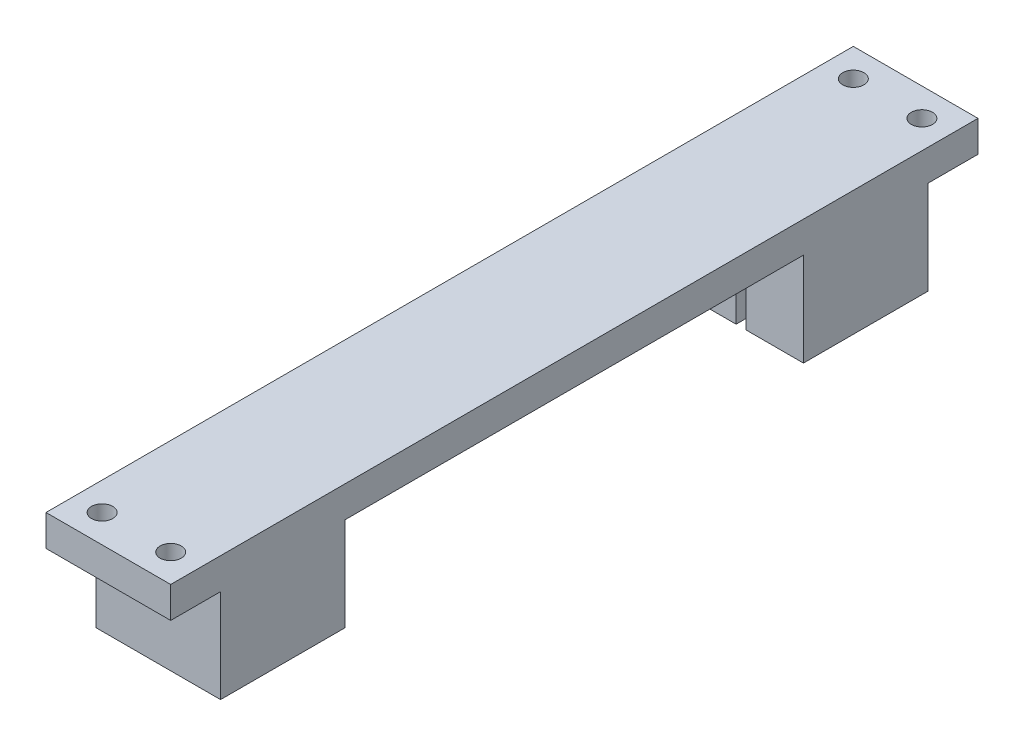
ISO-10303-21;
HEADER;
FILE_DESCRIPTION(('STEP AP214'),'2;1');
FILE_NAME('part.step','',(''),(''),'','','');
FILE_SCHEMA(('AUTOMOTIVE_DESIGN { 1 0 10303 214 1 1 1 1 }'));
ENDSEC;
DATA;
#1=APPLICATION_CONTEXT('core data for automotive mechanical design processes');
#2=APPLICATION_PROTOCOL_DEFINITION('international standard','automotive_design',2000,#1);
#3=PRODUCT_CONTEXT('',#1,'mechanical');
#4=PRODUCT('Part','Part','',(#3));
#5=PRODUCT_RELATED_PRODUCT_CATEGORY('part','',(#4));
#6=PRODUCT_DEFINITION_FORMATION('','',#4);
#7=PRODUCT_DEFINITION_CONTEXT('part definition',#1,'design');
#8=PRODUCT_DEFINITION('design','',#6,#7);
#9=PRODUCT_DEFINITION_SHAPE('','',#8);
#10=(LENGTH_UNIT() NAMED_UNIT(*) SI_UNIT(.MILLI.,.METRE.));
#11=(NAMED_UNIT(*) PLANE_ANGLE_UNIT() SI_UNIT($,.RADIAN.));
#12=(NAMED_UNIT(*) SI_UNIT($,.STERADIAN.) SOLID_ANGLE_UNIT());
#13=UNCERTAINTY_MEASURE_WITH_UNIT(LENGTH_MEASURE(1.E-05),#10,'distance_accuracy_value','');
#14=(GEOMETRIC_REPRESENTATION_CONTEXT(3) GLOBAL_UNCERTAINTY_ASSIGNED_CONTEXT((#13)) GLOBAL_UNIT_ASSIGNED_CONTEXT((#10,
#11,#12)) REPRESENTATION_CONTEXT('',''));
#15=CARTESIAN_POINT('',(0.,0.,0.));
#16=DIRECTION('',(0.,0.,1.));
#17=DIRECTION('',(1.,0.,0.));
#18=AXIS2_PLACEMENT_3D('',#15,#16,#17);
#19=CARTESIAN_POINT('',(10.,-15.,-87.5));
#20=DIRECTION('',(0.,0.,-1.));
#21=DIRECTION('',(-1.,0.,0.));
#22=AXIS2_PLACEMENT_3D('',#19,#20,#21);
#23=PLANE('',#22);
#24=DIRECTION('',(-1.,0.,0.));
#25=VECTOR('',#24,1.);
#26=CARTESIAN_POINT('',(10.,-15.,-87.5));
#27=LINE('',#26,#25);
#28=CARTESIAN_POINT('',(-0.799999999999998,-15.,-87.5));
#29=VERTEX_POINT('',#28);
#30=CARTESIAN_POINT('',(-10.,-15.,-87.5));
#31=VERTEX_POINT('',#30);
#32=EDGE_CURVE('E207',#29,#31,#27,.T.);
#33=ORIENTED_EDGE('',*,*,#32,.F.);
#34=DIRECTION('',(0.,1.,0.));
#35=VECTOR('',#34,1.);
#36=CARTESIAN_POINT('',(-0.799999999999999,-15.,-87.5));
#37=LINE('',#36,#35);
#38=CARTESIAN_POINT('',(-0.799999999999998,0.,-87.5));
#39=VERTEX_POINT('',#38);
#40=EDGE_CURVE('E202',#29,#39,#37,.T.);
#41=ORIENTED_EDGE('',*,*,#40,.T.);
#42=DIRECTION('',(-1.,0.,0.));
#43=VECTOR('',#42,1.);
#44=CARTESIAN_POINT('',(10.,0.,-87.5));
#45=LINE('',#44,#43);
#46=CARTESIAN_POINT('',(-10.,0.,-87.5));
#47=VERTEX_POINT('',#46);
#48=EDGE_CURVE('E178',#39,#47,#45,.T.);
#49=ORIENTED_EDGE('',*,*,#48,.T.);
#50=DIRECTION('',(0.,1.,0.));
#51=VECTOR('',#50,1.);
#52=CARTESIAN_POINT('',(-10.,-15.,-87.5));
#53=LINE('',#52,#51);
#54=EDGE_CURVE('E224',#31,#47,#53,.T.);
#55=ORIENTED_EDGE('',*,*,#54,.F.);
#56=EDGE_LOOP('',(#33,#41,#49,#55));
#57=FACE_BOUND('',#56,.T.);
#58=ADVANCED_FACE('F33',(#57),#23,.F.);
#59=CARTESIAN_POINT('',(0.,0.,0.));
#60=DIRECTION('',(0.,-1.,0.));
#61=DIRECTION('',(0.,0.,-1.));
#62=AXIS2_PLACEMENT_3D('',#59,#60,#61);
#63=PLANE('',#62);
#64=ORIENTED_EDGE('',*,*,#48,.F.);
#65=DIRECTION('',(0.,0.,-1.));
#66=VECTOR('',#65,1.);
#67=CARTESIAN_POINT('',(-0.799999999999998,0.,-60.));
#68=LINE('',#67,#66);
#69=CARTESIAN_POINT('',(-0.799999999999998,0.,-95.5));
#70=VERTEX_POINT('',#69);
#71=EDGE_CURVE('E173',#39,#70,#68,.T.);
#72=ORIENTED_EDGE('',*,*,#71,.T.);
#73=DIRECTION('',(1.,0.,0.));
#74=VECTOR('',#73,1.);
#75=CARTESIAN_POINT('',(-0.799999999999998,0.,-95.5));
#76=LINE('',#75,#74);
#77=CARTESIAN_POINT('',(0.800000000000002,0.,-95.5));
#78=VERTEX_POINT('',#77);
#79=EDGE_CURVE('E176',#70,#78,#76,.T.);
#80=ORIENTED_EDGE('',*,*,#79,.T.);
#81=DIRECTION('',(0.,0.,1.));
#82=VECTOR('',#81,1.);
#83=CARTESIAN_POINT('',(0.800000000000002,0.,-60.));
#84=LINE('',#83,#82);
#85=CARTESIAN_POINT('',(0.800000000000002,0.,-87.5));
#86=VERTEX_POINT('',#85);
#87=EDGE_CURVE('E186',#78,#86,#84,.T.);
#88=ORIENTED_EDGE('',*,*,#87,.T.);
#89=CARTESIAN_POINT('',(10.,0.,-87.5));
#90=VERTEX_POINT('',#89);
#91=EDGE_CURVE('E217',#90,#86,#45,.T.);
#92=ORIENTED_EDGE('',*,*,#91,.F.);
#93=DIRECTION('',(0.,0.,1.));
#94=VECTOR('',#93,1.);
#95=CARTESIAN_POINT('',(10.,0.,-107.5));
#96=LINE('',#95,#94);
#97=CARTESIAN_POINT('',(10.,0.,-14.));
#98=VERTEX_POINT('',#97);
#99=EDGE_CURVE('E257',#90,#98,#96,.T.);
#100=ORIENTED_EDGE('',*,*,#99,.T.);
#101=DIRECTION('',(-1.,0.,0.));
#102=VECTOR('',#101,1.);
#103=CARTESIAN_POINT('',(-10.,0.,-14.));
#104=LINE('',#103,#102);
#105=CARTESIAN_POINT('',(0.799999999999999,0.,-14.));
#106=VERTEX_POINT('',#105);
#107=EDGE_CURVE('E241',#98,#106,#104,.T.);
#108=ORIENTED_EDGE('',*,*,#107,.T.);
#109=DIRECTION('',(0.,0.,1.));
#110=VECTOR('',#109,1.);
#111=CARTESIAN_POINT('',(0.799999999999999,0.,-14.));
#112=LINE('',#111,#110);
#113=CARTESIAN_POINT('',(0.799999999999998,0.,-6.5));
#114=VERTEX_POINT('',#113);
#115=EDGE_CURVE('E287',#106,#114,#112,.T.);
#116=ORIENTED_EDGE('',*,*,#115,.T.);
#117=DIRECTION('',(-1.,0.,0.));
#118=VECTOR('',#117,1.);
#119=CARTESIAN_POINT('',(0.799999999999998,0.,-6.5));
#120=LINE('',#119,#118);
#121=CARTESIAN_POINT('',(-0.800000000000002,0.,-6.5));
#122=VERTEX_POINT('',#121);
#123=EDGE_CURVE('E290',#114,#122,#120,.T.);
#124=ORIENTED_EDGE('',*,*,#123,.T.);
#125=DIRECTION('',(0.,0.,-1.));
#126=VECTOR('',#125,1.);
#127=CARTESIAN_POINT('',(-0.800000000000001,0.,-14.));
#128=LINE('',#127,#126);
#129=CARTESIAN_POINT('',(-0.800000000000001,0.,-14.));
#130=VERTEX_POINT('',#129);
#131=EDGE_CURVE('E294',#122,#130,#128,.T.);
#132=ORIENTED_EDGE('',*,*,#131,.T.);
#133=CARTESIAN_POINT('',(-10.,0.,-14.));
#134=VERTEX_POINT('',#133);
#135=EDGE_CURVE('E41',#130,#134,#104,.T.);
#136=ORIENTED_EDGE('',*,*,#135,.T.);
#137=DIRECTION('',(0.,0.,1.));
#138=VECTOR('',#137,1.);
#139=CARTESIAN_POINT('',(-10.,0.,-107.5));
#140=LINE('',#139,#138);
#141=EDGE_CURVE('E258',#47,#134,#140,.T.);
#142=ORIENTED_EDGE('',*,*,#141,.F.);
#143=EDGE_LOOP('',(#64,#72,#80,#88,#92,#100,#108,#116,#124,#132,#136,#142));
#144=FACE_BOUND('',#143,.T.);
#145=ADVANCED_FACE('F174',(#144),#63,.T.);
#146=CARTESIAN_POINT('',(5.5,0.,-111.));
#147=DIRECTION('',(0.,-1.,0.));
#148=DIRECTION('',(0.,0.,-1.));
#149=AXIS2_PLACEMENT_3D('',#146,#147,#148);
#150=CIRCLE('',#149,1.69999999999999);
#151=CARTESIAN_POINT('',(5.5,0.,-112.7));
#152=VERTEX_POINT('',#151);
#153=EDGE_CURVE('E714',#152,#152,#150,.T.);
#154=ORIENTED_EDGE('',*,*,#153,.F.);
#155=EDGE_LOOP('',(#154));
#156=FACE_BOUND('',#155,.T.);
#157=CARTESIAN_POINT('',(-5.5,0.,-111.));
#158=DIRECTION('',(0.,-1.,0.));
#159=DIRECTION('',(0.,0.,-1.));
#160=AXIS2_PLACEMENT_3D('',#157,#158,#159);
#161=CIRCLE('',#160,1.69999999999999);
#162=CARTESIAN_POINT('',(-5.5,0.,-112.7));
#163=VERTEX_POINT('',#162);
#164=EDGE_CURVE('E716',#163,#163,#161,.T.);
#165=ORIENTED_EDGE('',*,*,#164,.F.);
#166=EDGE_LOOP('',(#165));
#167=FACE_BOUND('',#166,.T.);
#168=CARTESIAN_POINT('',(10.,0.,-115.5));
#169=VERTEX_POINT('',#168);
#170=CARTESIAN_POINT('',(10.,0.,-107.5));
#171=VERTEX_POINT('',#170);
#172=EDGE_CURVE('E268',#169,#171,#96,.T.);
#173=ORIENTED_EDGE('',*,*,#172,.T.);
#174=DIRECTION('',(1.,0.,0.));
#175=VECTOR('',#174,1.);
#176=CARTESIAN_POINT('',(10.,0.,-107.5));
#177=LINE('',#176,#175);
#178=CARTESIAN_POINT('',(-10.,0.,-107.5));
#179=VERTEX_POINT('',#178);
#180=EDGE_CURVE('E208',#179,#171,#177,.T.);
#181=ORIENTED_EDGE('',*,*,#180,.F.);
#182=CARTESIAN_POINT('',(-10.,0.,-115.5));
#183=VERTEX_POINT('',#182);
#184=EDGE_CURVE('E254',#183,#179,#140,.T.);
#185=ORIENTED_EDGE('',*,*,#184,.F.);
#186=DIRECTION('',(-1.,0.,0.));
#187=VECTOR('',#186,1.);
#188=CARTESIAN_POINT('',(10.,0.,-115.5));
#189=LINE('',#188,#187);
#190=EDGE_CURVE('E232',#169,#183,#189,.T.);
#191=ORIENTED_EDGE('',*,*,#190,.F.);
#192=EDGE_LOOP('',(#173,#181,#185,#191));
#193=FACE_BOUND('',#192,.T.);
#194=ADVANCED_FACE('F429',(#156,#167,#193),#63,.T.);
#195=CARTESIAN_POINT('',(-10.,5.,-14.));
#196=DIRECTION('',(0.,0.,-1.));
#197=DIRECTION('',(-1.,0.,0.));
#198=AXIS2_PLACEMENT_3D('',#195,#196,#197);
#199=PLANE('',#198);
#200=ORIENTED_EDGE('',*,*,#107,.F.);
#201=DIRECTION('',(0.,-1.,0.));
#202=VECTOR('',#201,1.);
#203=CARTESIAN_POINT('',(10.,5.,-14.));
#204=LINE('',#203,#202);
#205=CARTESIAN_POINT('',(10.,-15.,-14.));
#206=VERTEX_POINT('',#205);
#207=EDGE_CURVE('E251',#98,#206,#204,.T.);
#208=ORIENTED_EDGE('',*,*,#207,.T.);
#209=DIRECTION('',(1.,0.,0.));
#210=VECTOR('',#209,1.);
#211=CARTESIAN_POINT('',(10.,-15.,-14.));
#212=LINE('',#211,#210);
#213=CARTESIAN_POINT('',(0.799999999999999,-15.,-14.));
#214=VERTEX_POINT('',#213);
#215=EDGE_CURVE('E324',#214,#206,#212,.T.);
#216=ORIENTED_EDGE('',*,*,#215,.F.);
#217=DIRECTION('',(0.,-1.,0.));
#218=VECTOR('',#217,1.);
#219=CARTESIAN_POINT('',(0.799999999999999,0.,-14.));
#220=LINE('',#219,#218);
#221=EDGE_CURVE('E282',#106,#214,#220,.T.);
#222=ORIENTED_EDGE('',*,*,#221,.F.);
#223=EDGE_LOOP('',(#200,#208,#216,#222));
#224=FACE_BOUND('',#223,.T.);
#225=ADVANCED_FACE('F414',(#224),#199,.T.);
#226=CARTESIAN_POINT('',(0.,5.,0.));
#227=DIRECTION('',(0.,1.,0.));
#228=DIRECTION('',(0.,0.,1.));
#229=AXIS2_PLACEMENT_3D('',#226,#227,#228);
#230=PLANE('',#229);
#231=CARTESIAN_POINT('',(5.5,5.,-111.));
#232=DIRECTION('',(0.,-1.,0.));
#233=DIRECTION('',(0.,0.,-1.));
#234=AXIS2_PLACEMENT_3D('',#231,#232,#233);
#235=CIRCLE('',#234,1.7);
#236=CARTESIAN_POINT('',(5.5,5.,-112.7));
#237=VERTEX_POINT('',#236);
#238=EDGE_CURVE('E712',#237,#237,#235,.T.);
#239=ORIENTED_EDGE('',*,*,#238,.T.);
#240=EDGE_LOOP('',(#239));
#241=FACE_BOUND('',#240,.T.);
#242=CARTESIAN_POINT('',(-5.5,5.,-111.));
#243=DIRECTION('',(0.,-1.,0.));
#244=DIRECTION('',(0.,0.,-1.));
#245=AXIS2_PLACEMENT_3D('',#242,#243,#244);
#246=CIRCLE('',#245,1.7);
#247=CARTESIAN_POINT('',(-5.5,5.,-112.7));
#248=VERTEX_POINT('',#247);
#249=EDGE_CURVE('E196',#248,#248,#246,.T.);
#250=ORIENTED_EDGE('',*,*,#249,.T.);
#251=EDGE_LOOP('',(#250));
#252=FACE_BOUND('',#251,.T.);
#253=CARTESIAN_POINT('',(-5.5,5.,9.50000000000001));
#254=DIRECTION('',(0.,1.,0.));
#255=DIRECTION('',(0.,0.,1.));
#256=AXIS2_PLACEMENT_3D('',#253,#254,#255);
#257=CIRCLE('',#256,1.69999999999999);
#258=CARTESIAN_POINT('',(-5.5,5.,11.2));
#259=VERTEX_POINT('',#258);
#260=EDGE_CURVE('E307',#259,#259,#257,.F.);
#261=ORIENTED_EDGE('',*,*,#260,.T.);
#262=EDGE_LOOP('',(#261));
#263=FACE_BOUND('',#262,.T.);
#264=DIRECTION('',(1.,0.,0.));
#265=VECTOR('',#264,1.);
#266=CARTESIAN_POINT('',(-10.,5.,14.));
#267=LINE('',#266,#265);
#268=CARTESIAN_POINT('',(-10.,5.,14.));
#269=VERTEX_POINT('',#268);
#270=CARTESIAN_POINT('',(10.,5.,14.));
#271=VERTEX_POINT('',#270);
#272=EDGE_CURVE('E331',#269,#271,#267,.T.);
#273=ORIENTED_EDGE('',*,*,#272,.T.);
#274=DIRECTION('',(0.,0.,-1.));
#275=VECTOR('',#274,1.);
#276=CARTESIAN_POINT('',(10.,5.,14.));
#277=LINE('',#276,#275);
#278=CARTESIAN_POINT('',(10.,5.,-115.5));
#279=VERTEX_POINT('',#278);
#280=EDGE_CURVE('E365',#271,#279,#277,.T.);
#281=ORIENTED_EDGE('',*,*,#280,.T.);
#282=DIRECTION('',(1.,0.,0.));
#283=VECTOR('',#282,1.);
#284=CARTESIAN_POINT('',(10.,5.,-115.5));
#285=LINE('',#284,#283);
#286=CARTESIAN_POINT('',(-10.,5.,-115.5));
#287=VERTEX_POINT('',#286);
#288=EDGE_CURVE('E238',#287,#279,#285,.T.);
#289=ORIENTED_EDGE('',*,*,#288,.F.);
#290=DIRECTION('',(0.,0.,-1.));
#291=VECTOR('',#290,1.);
#292=CARTESIAN_POINT('',(-10.,5.,14.));
#293=LINE('',#292,#291);
#294=EDGE_CURVE('E364',#269,#287,#293,.T.);
#295=ORIENTED_EDGE('',*,*,#294,.F.);
#296=EDGE_LOOP('',(#273,#281,#289,#295));
#297=FACE_BOUND('',#296,.T.);
#298=CARTESIAN_POINT('',(5.5,5.,9.50000000000001));
#299=DIRECTION('',(0.,1.,0.));
#300=DIRECTION('',(0.,0.,1.));
#301=AXIS2_PLACEMENT_3D('',#298,#299,#300);
#302=CIRCLE('',#301,1.69999999999999);
#303=CARTESIAN_POINT('',(5.5,5.,11.2));
#304=VERTEX_POINT('',#303);
#305=EDGE_CURVE('E278',#304,#304,#302,.F.);
#306=ORIENTED_EDGE('',*,*,#305,.T.);
#307=EDGE_LOOP('',(#306));
#308=FACE_BOUND('',#307,.T.);
#309=ADVANCED_FACE('F372',(#241,#252,#263,#297,#308),#230,.T.);
#310=CARTESIAN_POINT('',(0.,0.,0.));
#311=DIRECTION('',(0.,1.,0.));
#312=DIRECTION('',(0.,0.,1.));
#313=AXIS2_PLACEMENT_3D('',#310,#311,#312);
#314=PLANE('',#313);
#315=CARTESIAN_POINT('',(5.5,0.,9.50000000000001));
#316=DIRECTION('',(0.,-1.,0.));
#317=DIRECTION('',(0.,0.,-1.));
#318=AXIS2_PLACEMENT_3D('',#315,#316,#317);
#319=CIRCLE('',#318,1.69999999999999);
#320=CARTESIAN_POINT('',(5.5,0.,7.80000000000001));
#321=VERTEX_POINT('',#320);
#322=EDGE_CURVE('E274',#321,#321,#319,.T.);
#323=ORIENTED_EDGE('',*,*,#322,.F.);
#324=EDGE_LOOP('',(#323));
#325=FACE_BOUND('',#324,.T.);
#326=CARTESIAN_POINT('',(-5.5,0.,9.50000000000001));
#327=DIRECTION('',(0.,-1.,0.));
#328=DIRECTION('',(0.,0.,-1.));
#329=AXIS2_PLACEMENT_3D('',#326,#327,#328);
#330=CIRCLE('',#329,1.69999999999999);
#331=CARTESIAN_POINT('',(-5.5,0.,7.80000000000001));
#332=VERTEX_POINT('',#331);
#333=EDGE_CURVE('E473',#332,#332,#330,.T.);
#334=ORIENTED_EDGE('',*,*,#333,.F.);
#335=EDGE_LOOP('',(#334));
#336=FACE_BOUND('',#335,.T.);
#337=DIRECTION('',(-1.,0.,0.));
#338=VECTOR('',#337,1.);
#339=CARTESIAN_POINT('',(10.,0.,6.00000000000001));
#340=LINE('',#339,#338);
#341=CARTESIAN_POINT('',(10.,0.,6.00000000000001));
#342=VERTEX_POINT('',#341);
#343=CARTESIAN_POINT('',(-10.,0.,6.00000000000001));
#344=VERTEX_POINT('',#343);
#345=EDGE_CURVE('E284',#342,#344,#340,.T.);
#346=ORIENTED_EDGE('',*,*,#345,.F.);
#347=DIRECTION('',(0.,0.,-1.));
#348=VECTOR('',#347,1.);
#349=CARTESIAN_POINT('',(10.,0.,14.));
#350=LINE('',#349,#348);
#351=CARTESIAN_POINT('',(10.,0.,14.));
#352=VERTEX_POINT('',#351);
#353=EDGE_CURVE('E337',#352,#342,#350,.T.);
#354=ORIENTED_EDGE('',*,*,#353,.F.);
#355=DIRECTION('',(1.,0.,0.));
#356=VECTOR('',#355,1.);
#357=CARTESIAN_POINT('',(-10.,0.,14.));
#358=LINE('',#357,#356);
#359=CARTESIAN_POINT('',(-10.,0.,14.));
#360=VERTEX_POINT('',#359);
#361=EDGE_CURVE('E347',#360,#352,#358,.T.);
#362=ORIENTED_EDGE('',*,*,#361,.F.);
#363=DIRECTION('',(0.,0.,-1.));
#364=VECTOR('',#363,1.);
#365=CARTESIAN_POINT('',(-10.,0.,14.));
#366=LINE('',#365,#364);
#367=EDGE_CURVE('E358',#360,#344,#366,.T.);
#368=ORIENTED_EDGE('',*,*,#367,.T.);
#369=EDGE_LOOP('',(#346,#354,#362,#368));
#370=FACE_BOUND('',#369,.T.);
#371=ADVANCED_FACE('F388',(#325,#336,#370),#314,.F.);
#372=CARTESIAN_POINT('',(-10.,5.,14.));
#373=DIRECTION('',(0.,0.,-1.));
#374=DIRECTION('',(-1.,0.,0.));
#375=AXIS2_PLACEMENT_3D('',#372,#373,#374);
#376=PLANE('',#375);
#377=ORIENTED_EDGE('',*,*,#361,.T.);
#378=DIRECTION('',(0.,-1.,0.));
#379=VECTOR('',#378,1.);
#380=CARTESIAN_POINT('',(10.,5.,14.));
#381=LINE('',#380,#379);
#382=EDGE_CURVE('E250',#271,#352,#381,.T.);
#383=ORIENTED_EDGE('',*,*,#382,.F.);
#384=ORIENTED_EDGE('',*,*,#272,.F.);
#385=DIRECTION('',(0.,-1.,0.));
#386=VECTOR('',#385,1.);
#387=CARTESIAN_POINT('',(-10.,5.,14.));
#388=LINE('',#387,#386);
#389=EDGE_CURVE('E351',#269,#360,#388,.T.);
#390=ORIENTED_EDGE('',*,*,#389,.T.);
#391=EDGE_LOOP('',(#377,#383,#384,#390));
#392=FACE_BOUND('',#391,.T.);
#393=ADVANCED_FACE('F35',(#392),#376,.F.);
#394=CARTESIAN_POINT('',(10.,5.,14.));
#395=DIRECTION('',(-1.,0.,0.));
#396=DIRECTION('',(0.,0.,1.));
#397=AXIS2_PLACEMENT_3D('',#394,#395,#396);
#398=PLANE('',#397);
#399=ORIENTED_EDGE('',*,*,#353,.T.);
#400=DIRECTION('',(0.,1.,0.));
#401=VECTOR('',#400,1.);
#402=CARTESIAN_POINT('',(10.,-15.,6.00000000000001));
#403=LINE('',#402,#401);
#404=CARTESIAN_POINT('',(10.,-15.,6.00000000000001));
#405=VERTEX_POINT('',#404);
#406=EDGE_CURVE('E342',#405,#342,#403,.T.);
#407=ORIENTED_EDGE('',*,*,#406,.F.);
#408=DIRECTION('',(0.,0.,1.));
#409=VECTOR('',#408,1.);
#410=CARTESIAN_POINT('',(10.,-15.,-14.));
#411=LINE('',#410,#409);
#412=EDGE_CURVE('E316',#206,#405,#411,.T.);
#413=ORIENTED_EDGE('',*,*,#412,.F.);
#414=ORIENTED_EDGE('',*,*,#207,.F.);
#415=ORIENTED_EDGE('',*,*,#99,.F.);
#416=DIRECTION('',(0.,1.,0.));
#417=VECTOR('',#416,1.);
#418=CARTESIAN_POINT('',(10.,-15.,-87.5));
#419=LINE('',#418,#417);
#420=CARTESIAN_POINT('',(10.,-15.,-87.5));
#421=VERTEX_POINT('',#420);
#422=EDGE_CURVE('E227',#421,#90,#419,.T.);
#423=ORIENTED_EDGE('',*,*,#422,.F.);
#424=DIRECTION('',(0.,0.,1.));
#425=VECTOR('',#424,1.);
#426=CARTESIAN_POINT('',(10.,-15.,-87.5));
#427=LINE('',#426,#425);
#428=CARTESIAN_POINT('',(10.,-15.,-107.5));
#429=VERTEX_POINT('',#428);
#430=EDGE_CURVE('E204',#429,#421,#427,.T.);
#431=ORIENTED_EDGE('',*,*,#430,.F.);
#432=DIRECTION('',(0.,1.,0.));
#433=VECTOR('',#432,1.);
#434=CARTESIAN_POINT('',(10.,-15.,-107.5));
#435=LINE('',#434,#433);
#436=EDGE_CURVE('E216',#429,#171,#435,.T.);
#437=ORIENTED_EDGE('',*,*,#436,.T.);
#438=ORIENTED_EDGE('',*,*,#172,.F.);
#439=DIRECTION('',(0.,-1.,0.));
#440=VECTOR('',#439,1.);
#441=CARTESIAN_POINT('',(10.,5.,-115.5));
#442=LINE('',#441,#440);
#443=EDGE_CURVE('E229',#279,#169,#442,.T.);
#444=ORIENTED_EDGE('',*,*,#443,.F.);
#445=ORIENTED_EDGE('',*,*,#280,.F.);
#446=ORIENTED_EDGE('',*,*,#382,.T.);
#447=EDGE_LOOP('',(#399,#407,#413,#414,#415,#423,#431,#437,#438,#444,#445,#446));
#448=FACE_BOUND('',#447,.T.);
#449=ADVANCED_FACE('F378',(#448),#398,.F.);
#450=ORIENTED_EDGE('',*,*,#135,.F.);
#451=DIRECTION('',(0.,-1.,0.));
#452=VECTOR('',#451,1.);
#453=CARTESIAN_POINT('',(-0.800000000000001,0.,-14.));
#454=LINE('',#453,#452);
#455=CARTESIAN_POINT('',(-0.800000000000001,-15.,-14.));
#456=VERTEX_POINT('',#455);
#457=EDGE_CURVE('E261',#130,#456,#454,.T.);
#458=ORIENTED_EDGE('',*,*,#457,.T.);
#459=CARTESIAN_POINT('',(-10.,-15.,-14.));
#460=VERTEX_POINT('',#459);
#461=EDGE_CURVE('E325',#460,#456,#212,.T.);
#462=ORIENTED_EDGE('',*,*,#461,.F.);
#463=DIRECTION('',(0.,-1.,0.));
#464=VECTOR('',#463,1.);
#465=CARTESIAN_POINT('',(-10.,5.,-14.));
#466=LINE('',#465,#464);
#467=EDGE_CURVE('E349',#134,#460,#466,.T.);
#468=ORIENTED_EDGE('',*,*,#467,.F.);
#469=EDGE_LOOP('',(#450,#458,#462,#468));
#470=FACE_BOUND('',#469,.T.);
#471=ADVANCED_FACE('F401',(#470),#199,.T.);
#472=CARTESIAN_POINT('',(-10.,5.,14.));
#473=DIRECTION('',(-1.,0.,0.));
#474=DIRECTION('',(0.,0.,1.));
#475=AXIS2_PLACEMENT_3D('',#472,#473,#474);
#476=PLANE('',#475);
#477=ORIENTED_EDGE('',*,*,#367,.F.);
#478=ORIENTED_EDGE('',*,*,#389,.F.);
#479=ORIENTED_EDGE('',*,*,#294,.T.);
#480=DIRECTION('',(0.,1.,0.));
#481=VECTOR('',#480,1.);
#482=CARTESIAN_POINT('',(-10.,5.,-115.5));
#483=LINE('',#482,#481);
#484=EDGE_CURVE('E235',#183,#287,#483,.T.);
#485=ORIENTED_EDGE('',*,*,#484,.F.);
#486=ORIENTED_EDGE('',*,*,#184,.T.);
#487=DIRECTION('',(0.,1.,0.));
#488=VECTOR('',#487,1.);
#489=CARTESIAN_POINT('',(-10.,-15.,-107.5));
#490=LINE('',#489,#488);
#491=CARTESIAN_POINT('',(-10.,-15.,-107.5));
#492=VERTEX_POINT('',#491);
#493=EDGE_CURVE('E56',#492,#179,#490,.T.);
#494=ORIENTED_EDGE('',*,*,#493,.F.);
#495=DIRECTION('',(0.,0.,-1.));
#496=VECTOR('',#495,1.);
#497=CARTESIAN_POINT('',(-10.,-15.,-87.5));
#498=LINE('',#497,#496);
#499=EDGE_CURVE('E212',#31,#492,#498,.T.);
#500=ORIENTED_EDGE('',*,*,#499,.F.);
#501=ORIENTED_EDGE('',*,*,#54,.T.);
#502=ORIENTED_EDGE('',*,*,#141,.T.);
#503=ORIENTED_EDGE('',*,*,#467,.T.);
#504=DIRECTION('',(0.,0.,-1.));
#505=VECTOR('',#504,1.);
#506=CARTESIAN_POINT('',(-10.,-15.,-14.));
#507=LINE('',#506,#505);
#508=CARTESIAN_POINT('',(-10.,-15.,6.00000000000001));
#509=VERTEX_POINT('',#508);
#510=EDGE_CURVE('E321',#509,#460,#507,.T.);
#511=ORIENTED_EDGE('',*,*,#510,.F.);
#512=DIRECTION('',(0.,1.,0.));
#513=VECTOR('',#512,1.);
#514=CARTESIAN_POINT('',(-10.,-15.,6.00000000000001));
#515=LINE('',#514,#513);
#516=EDGE_CURVE('E328',#509,#344,#515,.T.);
#517=ORIENTED_EDGE('',*,*,#516,.T.);
#518=EDGE_LOOP('',(#477,#478,#479,#485,#486,#494,#500,#501,#502,#503,#511,#517));
#519=FACE_BOUND('',#518,.T.);
#520=ADVANCED_FACE('F386',(#519),#476,.T.);
#521=CARTESIAN_POINT('',(10.,-15.,6.00000000000001));
#522=DIRECTION('',(0.,0.,-1.));
#523=DIRECTION('',(-1.,0.,0.));
#524=AXIS2_PLACEMENT_3D('',#521,#522,#523);
#525=PLANE('',#524);
#526=ORIENTED_EDGE('',*,*,#345,.T.);
#527=ORIENTED_EDGE('',*,*,#516,.F.);
#528=DIRECTION('',(-1.,0.,0.));
#529=VECTOR('',#528,1.);
#530=CARTESIAN_POINT('',(10.,-15.,6.00000000000001));
#531=LINE('',#530,#529);
#532=EDGE_CURVE('E319',#405,#509,#531,.T.);
#533=ORIENTED_EDGE('',*,*,#532,.F.);
#534=ORIENTED_EDGE('',*,*,#406,.T.);
#535=EDGE_LOOP('',(#526,#527,#533,#534));
#536=FACE_BOUND('',#535,.T.);
#537=ADVANCED_FACE('F391',(#536),#525,.F.);
#538=CARTESIAN_POINT('',(0.,-15.,0.));
#539=DIRECTION('',(0.,-1.,0.));
#540=DIRECTION('',(0.,0.,-1.));
#541=AXIS2_PLACEMENT_3D('',#538,#539,#540);
#542=PLANE('',#541);
#543=DIRECTION('',(0.,0.,1.));
#544=VECTOR('',#543,1.);
#545=CARTESIAN_POINT('',(0.799999999999999,-15.,-14.));
#546=LINE('',#545,#544);
#547=CARTESIAN_POINT('',(0.799999999999998,-15.,-6.5));
#548=VERTEX_POINT('',#547);
#549=EDGE_CURVE('E309',#214,#548,#546,.T.);
#550=ORIENTED_EDGE('',*,*,#549,.F.);
#551=ORIENTED_EDGE('',*,*,#215,.T.);
#552=ORIENTED_EDGE('',*,*,#412,.T.);
#553=ORIENTED_EDGE('',*,*,#532,.T.);
#554=ORIENTED_EDGE('',*,*,#510,.T.);
#555=ORIENTED_EDGE('',*,*,#461,.T.);
#556=DIRECTION('',(0.,0.,-1.));
#557=VECTOR('',#556,1.);
#558=CARTESIAN_POINT('',(-0.800000000000001,-15.,-14.));
#559=LINE('',#558,#557);
#560=CARTESIAN_POINT('',(-0.800000000000002,-15.,-6.5));
#561=VERTEX_POINT('',#560);
#562=EDGE_CURVE('E291',#561,#456,#559,.T.);
#563=ORIENTED_EDGE('',*,*,#562,.F.);
#564=DIRECTION('',(-1.,0.,0.));
#565=VECTOR('',#564,1.);
#566=CARTESIAN_POINT('',(0.799999999999998,-15.,-6.5));
#567=LINE('',#566,#565);
#568=EDGE_CURVE('E311',#548,#561,#567,.T.);
#569=ORIENTED_EDGE('',*,*,#568,.F.);
#570=EDGE_LOOP('',(#550,#551,#552,#553,#554,#555,#563,#569));
#571=FACE_BOUND('',#570,.T.);
#572=ADVANCED_FACE('F397',(#571),#542,.T.);
#573=CARTESIAN_POINT('',(0.799999999999999,0.,-14.));
#574=DIRECTION('',(1.,0.,0.));
#575=DIRECTION('',(0.,0.,-1.));
#576=AXIS2_PLACEMENT_3D('',#573,#574,#575);
#577=PLANE('',#576);
#578=ORIENTED_EDGE('',*,*,#549,.T.);
#579=DIRECTION('',(0.,-1.,0.));
#580=VECTOR('',#579,1.);
#581=CARTESIAN_POINT('',(0.799999999999998,0.,-6.5));
#582=LINE('',#581,#580);
#583=EDGE_CURVE('E296',#114,#548,#582,.T.);
#584=ORIENTED_EDGE('',*,*,#583,.F.);
#585=ORIENTED_EDGE('',*,*,#115,.F.);
#586=ORIENTED_EDGE('',*,*,#221,.T.);
#587=EDGE_LOOP('',(#578,#584,#585,#586));
#588=FACE_BOUND('',#587,.T.);
#589=ADVANCED_FACE('F411',(#588),#577,.F.);
#590=CARTESIAN_POINT('',(-0.800000000000001,0.,-14.));
#591=DIRECTION('',(-1.,0.,0.));
#592=DIRECTION('',(0.,0.,1.));
#593=AXIS2_PLACEMENT_3D('',#590,#591,#592);
#594=PLANE('',#593);
#595=ORIENTED_EDGE('',*,*,#562,.T.);
#596=ORIENTED_EDGE('',*,*,#457,.F.);
#597=ORIENTED_EDGE('',*,*,#131,.F.);
#598=DIRECTION('',(0.,-1.,0.));
#599=VECTOR('',#598,1.);
#600=CARTESIAN_POINT('',(-0.800000000000002,0.,-6.5));
#601=LINE('',#600,#599);
#602=EDGE_CURVE('E301',#122,#561,#601,.T.);
#603=ORIENTED_EDGE('',*,*,#602,.T.);
#604=EDGE_LOOP('',(#595,#596,#597,#603));
#605=FACE_BOUND('',#604,.T.);
#606=ADVANCED_FACE('F404',(#605),#594,.F.);
#607=CARTESIAN_POINT('',(0.799999999999998,0.,-6.5));
#608=DIRECTION('',(0.,0.,1.));
#609=DIRECTION('',(1.,0.,0.));
#610=AXIS2_PLACEMENT_3D('',#607,#608,#609);
#611=PLANE('',#610);
#612=ORIENTED_EDGE('',*,*,#568,.T.);
#613=ORIENTED_EDGE('',*,*,#602,.F.);
#614=ORIENTED_EDGE('',*,*,#123,.F.);
#615=ORIENTED_EDGE('',*,*,#583,.T.);
#616=EDGE_LOOP('',(#612,#613,#614,#615));
#617=FACE_BOUND('',#616,.T.);
#618=ADVANCED_FACE('F409',(#617),#611,.F.);
#619=CARTESIAN_POINT('',(-5.5,0.,9.50000000000001));
#620=DIRECTION('',(0.,-1.,0.));
#621=DIRECTION('',(0.,0.,-1.));
#622=AXIS2_PLACEMENT_3D('',#619,#620,#621);
#623=CYLINDRICAL_SURFACE('',#622,1.69999999999999);
#624=ORIENTED_EDGE('',*,*,#260,.F.);
#625=EDGE_LOOP('',(#624));
#626=FACE_BOUND('',#625,.T.);
#627=ORIENTED_EDGE('',*,*,#333,.T.);
#628=EDGE_LOOP('',(#627));
#629=FACE_BOUND('',#628,.T.);
#630=ADVANCED_FACE('F459',(#626,#629),#623,.F.);
#631=CARTESIAN_POINT('',(5.5,0.,9.50000000000001));
#632=DIRECTION('',(0.,-1.,0.));
#633=DIRECTION('',(0.,0.,-1.));
#634=AXIS2_PLACEMENT_3D('',#631,#632,#633);
#635=CYLINDRICAL_SURFACE('',#634,1.69999999999999);
#636=ORIENTED_EDGE('',*,*,#305,.F.);
#637=EDGE_LOOP('',(#636));
#638=FACE_BOUND('',#637,.T.);
#639=ORIENTED_EDGE('',*,*,#322,.T.);
#640=EDGE_LOOP('',(#639));
#641=FACE_BOUND('',#640,.T.);
#642=ADVANCED_FACE('F455',(#638,#641),#635,.F.);
#643=CARTESIAN_POINT('',(0.,0.,-115.5));
#644=DIRECTION('',(0.,0.,-1.));
#645=DIRECTION('',(-1.,0.,0.));
#646=AXIS2_PLACEMENT_3D('',#643,#644,#645);
#647=PLANE('',#646);
#648=ORIENTED_EDGE('',*,*,#443,.T.);
#649=ORIENTED_EDGE('',*,*,#190,.T.);
#650=ORIENTED_EDGE('',*,*,#484,.T.);
#651=ORIENTED_EDGE('',*,*,#288,.T.);
#652=EDGE_LOOP('',(#648,#649,#650,#651));
#653=FACE_BOUND('',#652,.T.);
#654=ADVANCED_FACE('F382',(#653),#647,.T.);
#655=ORIENTED_EDGE('',*,*,#91,.T.);
#656=DIRECTION('',(0.,-1.,0.));
#657=VECTOR('',#656,1.);
#658=CARTESIAN_POINT('',(0.800000000000002,-15.,-87.5));
#659=LINE('',#658,#657);
#660=CARTESIAN_POINT('',(0.800000000000002,-15.,-87.5));
#661=VERTEX_POINT('',#660);
#662=EDGE_CURVE('E198',#86,#661,#659,.T.);
#663=ORIENTED_EDGE('',*,*,#662,.T.);
#664=EDGE_CURVE('E209',#421,#661,#27,.T.);
#665=ORIENTED_EDGE('',*,*,#664,.F.);
#666=ORIENTED_EDGE('',*,*,#422,.T.);
#667=EDGE_LOOP('',(#655,#663,#665,#666));
#668=FACE_BOUND('',#667,.T.);
#669=ADVANCED_FACE('F420',(#668),#23,.F.);
#670=CARTESIAN_POINT('',(10.,-15.,-107.5));
#671=DIRECTION('',(0.,0.,1.));
#672=DIRECTION('',(1.,0.,0.));
#673=AXIS2_PLACEMENT_3D('',#670,#671,#672);
#674=PLANE('',#673);
#675=ORIENTED_EDGE('',*,*,#180,.T.);
#676=ORIENTED_EDGE('',*,*,#436,.F.);
#677=DIRECTION('',(1.,0.,0.));
#678=VECTOR('',#677,1.);
#679=CARTESIAN_POINT('',(10.,-15.,-107.5));
#680=LINE('',#679,#678);
#681=EDGE_CURVE('E214',#492,#429,#680,.T.);
#682=ORIENTED_EDGE('',*,*,#681,.F.);
#683=ORIENTED_EDGE('',*,*,#493,.T.);
#684=EDGE_LOOP('',(#675,#676,#682,#683));
#685=FACE_BOUND('',#684,.T.);
#686=ADVANCED_FACE('F428',(#685),#674,.F.);
#687=CARTESIAN_POINT('',(0.,-15.,0.));
#688=DIRECTION('',(0.,1.,0.));
#689=DIRECTION('',(0.,0.,1.));
#690=AXIS2_PLACEMENT_3D('',#687,#688,#689);
#691=PLANE('',#690);
#692=DIRECTION('',(1.,0.,0.));
#693=VECTOR('',#692,1.);
#694=CARTESIAN_POINT('',(-0.799999999999998,-15.,-95.5));
#695=LINE('',#694,#693);
#696=CARTESIAN_POINT('',(-0.799999999999998,-15.,-95.5));
#697=VERTEX_POINT('',#696);
#698=CARTESIAN_POINT('',(0.800000000000002,-15.,-95.5));
#699=VERTEX_POINT('',#698);
#700=EDGE_CURVE('E194',#697,#699,#695,.T.);
#701=ORIENTED_EDGE('',*,*,#700,.F.);
#702=DIRECTION('',(0.,0.,1.));
#703=VECTOR('',#702,1.);
#704=CARTESIAN_POINT('',(-0.799999999999998,-15.,0.));
#705=LINE('',#704,#703);
#706=EDGE_CURVE('E11',#697,#29,#705,.T.);
#707=ORIENTED_EDGE('',*,*,#706,.T.);
#708=ORIENTED_EDGE('',*,*,#32,.T.);
#709=ORIENTED_EDGE('',*,*,#499,.T.);
#710=ORIENTED_EDGE('',*,*,#681,.T.);
#711=ORIENTED_EDGE('',*,*,#430,.T.);
#712=ORIENTED_EDGE('',*,*,#664,.T.);
#713=DIRECTION('',(0.,0.,1.));
#714=VECTOR('',#713,1.);
#715=CARTESIAN_POINT('',(0.800000000000002,-15.,-60.));
#716=LINE('',#715,#714);
#717=EDGE_CURVE('E181',#699,#661,#716,.T.);
#718=ORIENTED_EDGE('',*,*,#717,.F.);
#719=EDGE_LOOP('',(#701,#707,#708,#709,#710,#711,#712,#718));
#720=FACE_BOUND('',#719,.T.);
#721=ADVANCED_FACE('F425',(#720),#691,.F.);
#722=CARTESIAN_POINT('',(-0.799999999999998,0.,-60.));
#723=DIRECTION('',(-1.,0.,0.));
#724=DIRECTION('',(0.,0.,1.));
#725=AXIS2_PLACEMENT_3D('',#722,#723,#724);
#726=PLANE('',#725);
#727=ORIENTED_EDGE('',*,*,#706,.F.);
#728=DIRECTION('',(0.,-1.,0.));
#729=VECTOR('',#728,1.);
#730=CARTESIAN_POINT('',(-0.799999999999998,0.,-95.5));
#731=LINE('',#730,#729);
#732=EDGE_CURVE('E48',#70,#697,#731,.T.);
#733=ORIENTED_EDGE('',*,*,#732,.F.);
#734=ORIENTED_EDGE('',*,*,#71,.F.);
#735=ORIENTED_EDGE('',*,*,#40,.F.);
#736=EDGE_LOOP('',(#727,#733,#734,#735));
#737=FACE_BOUND('',#736,.T.);
#738=ADVANCED_FACE('F183',(#737),#726,.F.);
#739=CARTESIAN_POINT('',(0.800000000000002,0.,-60.));
#740=DIRECTION('',(1.,0.,0.));
#741=DIRECTION('',(0.,0.,-1.));
#742=AXIS2_PLACEMENT_3D('',#739,#740,#741);
#743=PLANE('',#742);
#744=ORIENTED_EDGE('',*,*,#87,.F.);
#745=DIRECTION('',(0.,-1.,0.));
#746=VECTOR('',#745,1.);
#747=CARTESIAN_POINT('',(0.800000000000002,0.,-95.5));
#748=LINE('',#747,#746);
#749=EDGE_CURVE('E185',#78,#699,#748,.T.);
#750=ORIENTED_EDGE('',*,*,#749,.T.);
#751=ORIENTED_EDGE('',*,*,#717,.T.);
#752=ORIENTED_EDGE('',*,*,#662,.F.);
#753=EDGE_LOOP('',(#744,#750,#751,#752));
#754=FACE_BOUND('',#753,.T.);
#755=ADVANCED_FACE('F422',(#754),#743,.F.);
#756=CARTESIAN_POINT('',(-0.799999999999998,0.,-95.5));
#757=DIRECTION('',(0.,0.,-1.));
#758=DIRECTION('',(-1.,0.,0.));
#759=AXIS2_PLACEMENT_3D('',#756,#757,#758);
#760=PLANE('',#759);
#761=ORIENTED_EDGE('',*,*,#700,.T.);
#762=ORIENTED_EDGE('',*,*,#749,.F.);
#763=ORIENTED_EDGE('',*,*,#79,.F.);
#764=ORIENTED_EDGE('',*,*,#732,.T.);
#765=EDGE_LOOP('',(#761,#762,#763,#764));
#766=FACE_BOUND('',#765,.T.);
#767=ADVANCED_FACE('F188',(#766),#760,.F.);
#768=CARTESIAN_POINT('',(-5.5,0.,-111.));
#769=DIRECTION('',(0.,-1.,0.));
#770=DIRECTION('',(0.,0.,-1.));
#771=AXIS2_PLACEMENT_3D('',#768,#769,#770);
#772=CYLINDRICAL_SURFACE('',#771,1.69999999999999);
#773=ORIENTED_EDGE('',*,*,#249,.F.);
#774=EDGE_LOOP('',(#773));
#775=FACE_BOUND('',#774,.T.);
#776=ORIENTED_EDGE('',*,*,#164,.T.);
#777=EDGE_LOOP('',(#776));
#778=FACE_BOUND('',#777,.T.);
#779=ADVANCED_FACE('F574',(#775,#778),#772,.F.);
#780=CARTESIAN_POINT('',(5.5,0.,-111.));
#781=DIRECTION('',(0.,-1.,0.));
#782=DIRECTION('',(0.,0.,-1.));
#783=AXIS2_PLACEMENT_3D('',#780,#781,#782);
#784=CYLINDRICAL_SURFACE('',#783,1.69999999999999);
#785=ORIENTED_EDGE('',*,*,#238,.F.);
#786=EDGE_LOOP('',(#785));
#787=FACE_BOUND('',#786,.T.);
#788=ORIENTED_EDGE('',*,*,#153,.T.);
#789=EDGE_LOOP('',(#788));
#790=FACE_BOUND('',#789,.T.);
#791=ADVANCED_FACE('F579',(#787,#790),#784,.F.);
#792=CLOSED_SHELL('',(#58,#145,#194,#225,#309,#371,#393,#449,#471,#520,#537,#572,#589,#606,#618,
#630,#642,#654,#669,#686,#721,#738,#755,#767,#779,#791));
#793=MANIFOLD_SOLID_BREP('B2',#792);
#794=ADVANCED_BREP_SHAPE_REPRESENTATION('',(#18,#793),#14);
#795=SHAPE_DEFINITION_REPRESENTATION(#9,#794);
ENDSEC;
END-ISO-10303-21;
